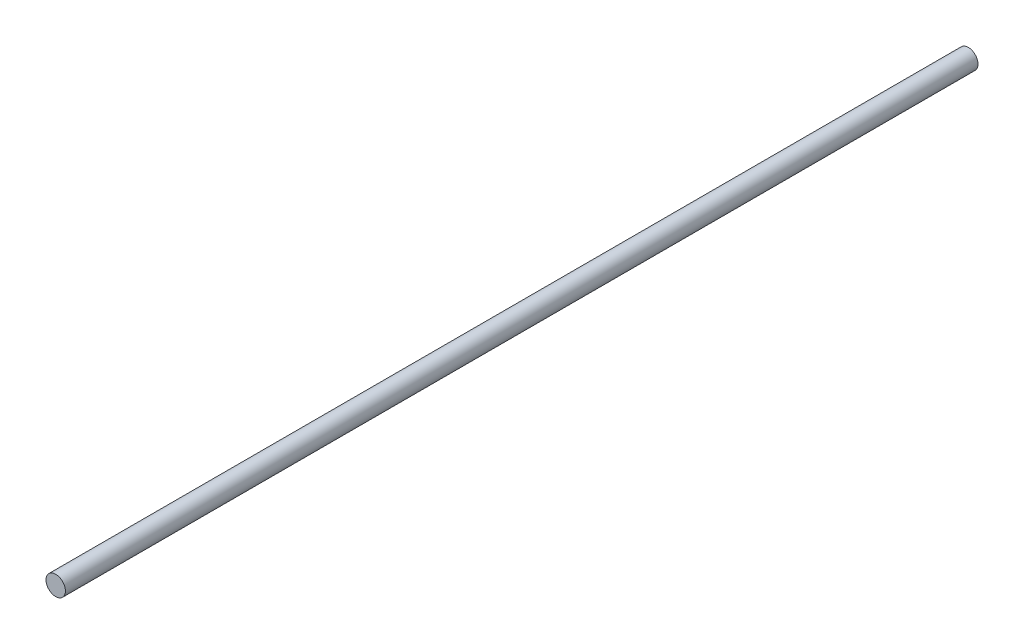
ISO-10303-21;
HEADER;
FILE_DESCRIPTION(('STEP AP214'),'2;1');
FILE_NAME('part.step','',(''),(''),'','','');
FILE_SCHEMA(('AUTOMOTIVE_DESIGN { 1 0 10303 214 1 1 1 1 }'));
ENDSEC;
DATA;
#1=APPLICATION_CONTEXT('core data for automotive mechanical design processes');
#2=APPLICATION_PROTOCOL_DEFINITION('international standard','automotive_design',2000,#1);
#3=PRODUCT_CONTEXT('',#1,'mechanical');
#4=PRODUCT('Part','Part','',(#3));
#5=PRODUCT_RELATED_PRODUCT_CATEGORY('part','',(#4));
#6=PRODUCT_DEFINITION_FORMATION('','',#4);
#7=PRODUCT_DEFINITION_CONTEXT('part definition',#1,'design');
#8=PRODUCT_DEFINITION('design','',#6,#7);
#9=PRODUCT_DEFINITION_SHAPE('','',#8);
#10=(LENGTH_UNIT() NAMED_UNIT(*) SI_UNIT(.MILLI.,.METRE.));
#11=(NAMED_UNIT(*) PLANE_ANGLE_UNIT() SI_UNIT($,.RADIAN.));
#12=(NAMED_UNIT(*) SI_UNIT($,.STERADIAN.) SOLID_ANGLE_UNIT());
#13=UNCERTAINTY_MEASURE_WITH_UNIT(LENGTH_MEASURE(1.E-05),#10,'distance_accuracy_value','');
#14=(GEOMETRIC_REPRESENTATION_CONTEXT(3) GLOBAL_UNCERTAINTY_ASSIGNED_CONTEXT((#13)) GLOBAL_UNIT_ASSIGNED_CONTEXT((#10,
#11,#12)) REPRESENTATION_CONTEXT('',''));
#15=CARTESIAN_POINT('',(0.,0.,0.));
#16=DIRECTION('',(0.,0.,1.));
#17=DIRECTION('',(1.,0.,0.));
#18=AXIS2_PLACEMENT_3D('',#15,#16,#17);
#19=CARTESIAN_POINT('',(0.,0.,117.5));
#20=DIRECTION('',(0.,0.,-1.));
#21=DIRECTION('',(-1.,0.,0.));
#22=AXIS2_PLACEMENT_3D('',#19,#20,#21);
#23=CYLINDRICAL_SURFACE('',#22,2.5);
#24=CARTESIAN_POINT('',(0.,0.,117.5));
#25=DIRECTION('',(0.,0.,1.));
#26=DIRECTION('',(1.,0.,0.));
#27=AXIS2_PLACEMENT_3D('',#24,#25,#26);
#28=CIRCLE('',#27,2.5);
#29=CARTESIAN_POINT('',(2.5,0.,117.5));
#30=VERTEX_POINT('',#29);
#31=EDGE_CURVE('E10',#30,#30,#28,.T.);
#32=ORIENTED_EDGE('',*,*,#31,.F.);
#33=EDGE_LOOP('',(#32));
#34=FACE_BOUND('',#33,.T.);
#35=CARTESIAN_POINT('',(0.,0.,-117.5));
#36=DIRECTION('',(0.,0.,1.));
#37=DIRECTION('',(1.,0.,0.));
#38=AXIS2_PLACEMENT_3D('',#35,#36,#37);
#39=CIRCLE('',#38,2.5);
#40=CARTESIAN_POINT('',(2.5,0.,-117.5));
#41=VERTEX_POINT('',#40);
#42=EDGE_CURVE('E35',#41,#41,#39,.T.);
#43=ORIENTED_EDGE('',*,*,#42,.T.);
#44=EDGE_LOOP('',(#43));
#45=FACE_BOUND('',#44,.T.);
#46=ADVANCED_FACE('F32',(#34,#45),#23,.T.);
#47=CARTESIAN_POINT('',(0.,0.,117.5));
#48=DIRECTION('',(0.,0.,1.));
#49=DIRECTION('',(1.,0.,0.));
#50=AXIS2_PLACEMENT_3D('',#47,#48,#49);
#51=PLANE('',#50);
#52=ORIENTED_EDGE('',*,*,#31,.T.);
#53=EDGE_LOOP('',(#52));
#54=FACE_BOUND('',#53,.T.);
#55=ADVANCED_FACE('F47',(#54),#51,.T.);
#56=CARTESIAN_POINT('',(0.,0.,-117.5));
#57=DIRECTION('',(0.,0.,1.));
#58=DIRECTION('',(1.,0.,0.));
#59=AXIS2_PLACEMENT_3D('',#56,#57,#58);
#60=PLANE('',#59);
#61=ORIENTED_EDGE('',*,*,#42,.F.);
#62=EDGE_LOOP('',(#61));
#63=FACE_BOUND('',#62,.T.);
#64=ADVANCED_FACE('F45',(#63),#60,.F.);
#65=CLOSED_SHELL('',(#46,#55,#64));
#66=MANIFOLD_SOLID_BREP('B2',#65);
#67=ADVANCED_BREP_SHAPE_REPRESENTATION('',(#18,#66),#14);
#68=SHAPE_DEFINITION_REPRESENTATION(#9,#67);
ENDSEC;
END-ISO-10303-21;
